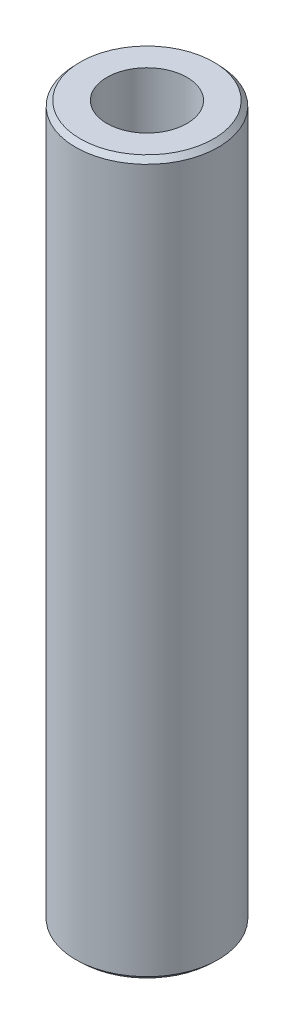
ISO-10303-21;
HEADER;
FILE_DESCRIPTION(('STEP AP214'),'2;1');
FILE_NAME('part.step','',(''),(''),'','','');
FILE_SCHEMA(('AUTOMOTIVE_DESIGN { 1 0 10303 214 1 1 1 1 }'));
ENDSEC;
DATA;
#1=APPLICATION_CONTEXT('core data for automotive mechanical design processes');
#2=APPLICATION_PROTOCOL_DEFINITION('international standard','automotive_design',2000,#1);
#3=PRODUCT_CONTEXT('',#1,'mechanical');
#4=PRODUCT('Part','Part','',(#3));
#5=PRODUCT_RELATED_PRODUCT_CATEGORY('part','',(#4));
#6=PRODUCT_DEFINITION_FORMATION('','',#4);
#7=PRODUCT_DEFINITION_CONTEXT('part definition',#1,'design');
#8=PRODUCT_DEFINITION('design','',#6,#7);
#9=PRODUCT_DEFINITION_SHAPE('','',#8);
#10=(LENGTH_UNIT() NAMED_UNIT(*) SI_UNIT(.MILLI.,.METRE.));
#11=(NAMED_UNIT(*) PLANE_ANGLE_UNIT() SI_UNIT($,.RADIAN.));
#12=(NAMED_UNIT(*) SI_UNIT($,.STERADIAN.) SOLID_ANGLE_UNIT());
#13=UNCERTAINTY_MEASURE_WITH_UNIT(LENGTH_MEASURE(1.E-05),#10,'distance_accuracy_value','');
#14=(GEOMETRIC_REPRESENTATION_CONTEXT(3) GLOBAL_UNCERTAINTY_ASSIGNED_CONTEXT((#13)) GLOBAL_UNIT_ASSIGNED_CONTEXT((#10,
#11,#12)) REPRESENTATION_CONTEXT('',''));
#15=CARTESIAN_POINT('',(0.,0.,0.));
#16=DIRECTION('',(0.,0.,1.));
#17=DIRECTION('',(1.,0.,0.));
#18=AXIS2_PLACEMENT_3D('',#15,#16,#17);
#19=CARTESIAN_POINT('',(0.,600.,0.));
#20=DIRECTION('',(0.,-1.,0.));
#21=DIRECTION('',(0.,0.,-1.));
#22=AXIS2_PLACEMENT_3D('',#19,#20,#21);
#23=CYLINDRICAL_SURFACE('',#22,60.);
#24=CARTESIAN_POINT('',(0.,595.830027746129,0.));
#25=DIRECTION('',(0.,1.,0.));
#26=DIRECTION('',(0.,0.,1.));
#27=AXIS2_PLACEMENT_3D('',#24,#25,#26);
#28=CIRCLE('',#27,60.);
#29=CARTESIAN_POINT('',(0.,595.830027746129,60.));
#30=VERTEX_POINT('',#29);
#31=EDGE_CURVE('E50',#30,#30,#28,.F.);
#32=ORIENTED_EDGE('',*,*,#31,.T.);
#33=EDGE_LOOP('',(#32));
#34=FACE_BOUND('',#33,.T.);
#35=CARTESIAN_POINT('',(0.,3.925439208736,0.));
#36=DIRECTION('',(0.,1.,0.));
#37=DIRECTION('',(0.,0.,1.));
#38=AXIS2_PLACEMENT_3D('',#35,#36,#37);
#39=CIRCLE('',#38,60.);
#40=CARTESIAN_POINT('',(0.,3.925439208736,60.));
#41=VERTEX_POINT('',#40);
#42=EDGE_CURVE('E51',#41,#41,#39,.T.);
#43=ORIENTED_EDGE('',*,*,#42,.T.);
#44=EDGE_LOOP('',(#43));
#45=FACE_BOUND('',#44,.T.);
#46=ADVANCED_FACE('F39',(#34,#45),#23,.T.);
#47=CARTESIAN_POINT('',(0.,600.,0.));
#48=DIRECTION('',(0.,1.,0.));
#49=DIRECTION('',(0.,0.,1.));
#50=AXIS2_PLACEMENT_3D('',#47,#48,#49);
#51=PLANE('',#50);
#52=CARTESIAN_POINT('',(0.,600.,0.));
#53=DIRECTION('',(0.,1.,0.));
#54=DIRECTION('',(0.,0.,1.));
#55=AXIS2_PLACEMENT_3D('',#52,#53,#54);
#56=CIRCLE('',#55,56.074560791264);
#57=CARTESIAN_POINT('',(0.,600.,56.074560791264));
#58=VERTEX_POINT('',#57);
#59=EDGE_CURVE('E54',#58,#58,#56,.T.);
#60=ORIENTED_EDGE('',*,*,#59,.T.);
#61=EDGE_LOOP('',(#60));
#62=FACE_BOUND('',#61,.T.);
#63=CARTESIAN_POINT('',(0.,600.,0.));
#64=DIRECTION('',(0.,1.,0.));
#65=DIRECTION('',(0.,0.,1.));
#66=AXIS2_PLACEMENT_3D('',#63,#64,#65);
#67=CIRCLE('',#66,33.6960015072283);
#68=CARTESIAN_POINT('',(0.,600.,33.6960015072283));
#69=VERTEX_POINT('',#68);
#70=EDGE_CURVE('E58',#69,#69,#67,.T.);
#71=ORIENTED_EDGE('',*,*,#70,.F.);
#72=EDGE_LOOP('',(#71));
#73=FACE_BOUND('',#72,.T.);
#74=ADVANCED_FACE('F69',(#62,#73),#51,.T.);
#75=CARTESIAN_POINT('',(0.,0.,0.));
#76=DIRECTION('',(0.,1.,0.));
#77=DIRECTION('',(0.,0.,1.));
#78=AXIS2_PLACEMENT_3D('',#75,#76,#77);
#79=PLANE('',#78);
#80=CARTESIAN_POINT('',(0.,0.,0.));
#81=DIRECTION('',(0.,1.,0.));
#82=DIRECTION('',(0.,0.,1.));
#83=AXIS2_PLACEMENT_3D('',#80,#81,#82);
#84=CIRCLE('',#83,55.8300277461287);
#85=CARTESIAN_POINT('',(0.,0.,55.8300277461287));
#86=VERTEX_POINT('',#85);
#87=EDGE_CURVE('E10',#86,#86,#84,.F.);
#88=ORIENTED_EDGE('',*,*,#87,.T.);
#89=EDGE_LOOP('',(#88));
#90=FACE_BOUND('',#89,.T.);
#91=CARTESIAN_POINT('',(0.,0.,0.));
#92=DIRECTION('',(0.,1.,0.));
#93=DIRECTION('',(0.,0.,1.));
#94=AXIS2_PLACEMENT_3D('',#91,#92,#93);
#95=CIRCLE('',#94,33.6960015072283);
#96=CARTESIAN_POINT('',(0.,0.,33.6960015072283));
#97=VERTEX_POINT('',#96);
#98=EDGE_CURVE('E63',#97,#97,#95,.T.);
#99=ORIENTED_EDGE('',*,*,#98,.T.);
#100=EDGE_LOOP('',(#99));
#101=FACE_BOUND('',#100,.T.);
#102=ADVANCED_FACE('F75',(#90,#101),#79,.F.);
#103=CARTESIAN_POINT('',(0.,600.,0.));
#104=DIRECTION('',(0.,-1.,0.));
#105=DIRECTION('',(0.,0.,-1.));
#106=AXIS2_PLACEMENT_3D('',#103,#104,#105);
#107=CYLINDRICAL_SURFACE('',#106,33.6960015072283);
#108=ORIENTED_EDGE('',*,*,#70,.T.);
#109=EDGE_LOOP('',(#108));
#110=FACE_BOUND('',#109,.T.);
#111=ORIENTED_EDGE('',*,*,#98,.F.);
#112=EDGE_LOOP('',(#111));
#113=FACE_BOUND('',#112,.T.);
#114=ADVANCED_FACE('F70',(#110,#113),#107,.F.);
#115=CARTESIAN_POINT('',(0.,600.,0.));
#116=DIRECTION('',(0.,-1.,0.));
#117=DIRECTION('',(0.,0.,-1.));
#118=AXIS2_PLACEMENT_3D('',#115,#116,#117);
#119=CONICAL_SURFACE('',#118,56.074560791264,0.75520096906683);
#120=ORIENTED_EDGE('',*,*,#31,.F.);
#121=EDGE_LOOP('',(#120));
#122=FACE_BOUND('',#121,.T.);
#123=ORIENTED_EDGE('',*,*,#59,.F.);
#124=EDGE_LOOP('',(#123));
#125=FACE_BOUND('',#124,.T.);
#126=ADVANCED_FACE('F81',(#122,#125),#119,.T.);
#127=CARTESIAN_POINT('',(0.,3.925439208736,0.));
#128=DIRECTION('',(0.,1.,0.));
#129=DIRECTION('',(0.,0.,1.));
#130=AXIS2_PLACEMENT_3D('',#127,#128,#129);
#131=CONICAL_SURFACE('',#130,60.,0.815595357728066);
#132=ORIENTED_EDGE('',*,*,#87,.F.);
#133=EDGE_LOOP('',(#132));
#134=FACE_BOUND('',#133,.T.);
#135=ORIENTED_EDGE('',*,*,#42,.F.);
#136=EDGE_LOOP('',(#135));
#137=FACE_BOUND('',#136,.T.);
#138=ADVANCED_FACE('F45',(#134,#137),#131,.T.);
#139=CLOSED_SHELL('',(#46,#74,#102,#114,#126,#138));
#140=MANIFOLD_SOLID_BREP('B2',#139);
#141=ADVANCED_BREP_SHAPE_REPRESENTATION('',(#18,#140),#14);
#142=SHAPE_DEFINITION_REPRESENTATION(#9,#141);
ENDSEC;
END-ISO-10303-21;
